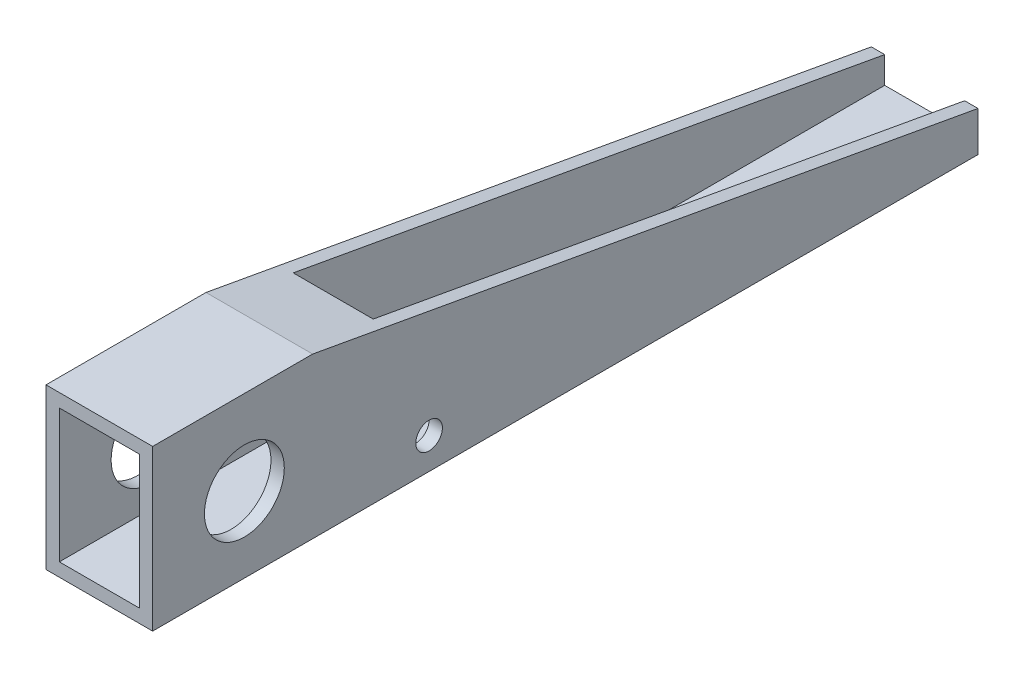
ISO-10303-21;
HEADER;
FILE_DESCRIPTION(('STEP AP214'),'2;1');
FILE_NAME('part.step','',(''),(''),'','','');
FILE_SCHEMA(('AUTOMOTIVE_DESIGN { 1 0 10303 214 1 1 1 1 }'));
ENDSEC;
DATA;
#1=APPLICATION_CONTEXT('core data for automotive mechanical design processes');
#2=APPLICATION_PROTOCOL_DEFINITION('international standard','automotive_design',2000,#1);
#3=PRODUCT_CONTEXT('',#1,'mechanical');
#4=PRODUCT('Part','Part','',(#3));
#5=PRODUCT_RELATED_PRODUCT_CATEGORY('part','',(#4));
#6=PRODUCT_DEFINITION_FORMATION('','',#4);
#7=PRODUCT_DEFINITION_CONTEXT('part definition',#1,'design');
#8=PRODUCT_DEFINITION('design','',#6,#7);
#9=PRODUCT_DEFINITION_SHAPE('','',#8);
#10=(LENGTH_UNIT() NAMED_UNIT(*) SI_UNIT(.MILLI.,.METRE.));
#11=(NAMED_UNIT(*) PLANE_ANGLE_UNIT() SI_UNIT($,.RADIAN.));
#12=(NAMED_UNIT(*) SI_UNIT($,.STERADIAN.) SOLID_ANGLE_UNIT());
#13=UNCERTAINTY_MEASURE_WITH_UNIT(LENGTH_MEASURE(1.E-05),#10,'distance_accuracy_value','');
#14=(GEOMETRIC_REPRESENTATION_CONTEXT(3) GLOBAL_UNCERTAINTY_ASSIGNED_CONTEXT((#13)) GLOBAL_UNIT_ASSIGNED_CONTEXT((#10,
#11,#12)) REPRESENTATION_CONTEXT('',''));
#15=CARTESIAN_POINT('',(0.,0.,0.));
#16=DIRECTION('',(0.,0.,1.));
#17=DIRECTION('',(1.,0.,0.));
#18=AXIS2_PLACEMENT_3D('',#15,#16,#17);
#19=CARTESIAN_POINT('',(0.,34.925,196.5706));
#20=DIRECTION('',(0.,-1.,0.));
#21=DIRECTION('',(0.,0.,-1.));
#22=AXIS2_PLACEMENT_3D('',#19,#20,#21);
#23=PLANE('',#22);
#24=DIRECTION('',(-1.,0.,0.));
#25=VECTOR('',#24,1.);
#26=CARTESIAN_POINT('',(0.,34.925,140.862755555556));
#27=LINE('',#26,#25);
#28=CARTESIAN_POINT('',(22.225,34.925,140.862755555556));
#29=VERTEX_POINT('',#28);
#30=CARTESIAN_POINT('',(3.175,34.925,140.862755555556));
#31=VERTEX_POINT('',#30);
#32=EDGE_CURVE('E193',#29,#31,#27,.T.);
#33=ORIENTED_EDGE('',*,*,#32,.F.);
#34=DIRECTION('',(0.,0.,-1.));
#35=VECTOR('',#34,1.);
#36=CARTESIAN_POINT('',(22.225,34.925,196.5706));
#37=LINE('',#36,#35);
#38=CARTESIAN_POINT('',(22.225,34.925,196.5706));
#39=VERTEX_POINT('',#38);
#40=EDGE_CURVE('E46',#39,#29,#37,.T.);
#41=ORIENTED_EDGE('',*,*,#40,.F.);
#42=DIRECTION('',(-1.,0.,0.));
#43=VECTOR('',#42,1.);
#44=CARTESIAN_POINT('',(0.,34.925,196.5706));
#45=LINE('',#44,#43);
#46=CARTESIAN_POINT('',(3.175,34.925,196.5706));
#47=VERTEX_POINT('',#46);
#48=EDGE_CURVE('E126',#39,#47,#45,.T.);
#49=ORIENTED_EDGE('',*,*,#48,.T.);
#50=DIRECTION('',(0.,0.,-1.));
#51=VECTOR('',#50,1.);
#52=CARTESIAN_POINT('',(3.175,34.925,196.5706));
#53=LINE('',#52,#51);
#54=EDGE_CURVE('E148',#47,#31,#53,.T.);
#55=ORIENTED_EDGE('',*,*,#54,.T.);
#56=EDGE_LOOP('',(#33,#41,#49,#55));
#57=FACE_BOUND('',#56,.T.);
#58=ADVANCED_FACE('F37',(#57),#23,.T.);
#59=CARTESIAN_POINT('',(22.225,0.,196.5706));
#60=DIRECTION('',(-1.,0.,0.));
#61=DIRECTION('',(0.,0.,1.));
#62=AXIS2_PLACEMENT_3D('',#59,#60,#61);
#63=PLANE('',#62);
#64=CARTESIAN_POINT('',(22.225,7.42583609972849,130.736416842445));
#65=DIRECTION('',(-1.,0.,0.));
#66=DIRECTION('',(0.,0.,1.));
#67=AXIS2_PLACEMENT_3D('',#64,#65,#66);
#68=CIRCLE('',#67,3.175);
#69=CARTESIAN_POINT('',(22.225,7.42583609972849,133.911416842445));
#70=VERTEX_POINT('',#69);
#71=EDGE_CURVE('E176',#70,#70,#68,.T.);
#72=ORIENTED_EDGE('',*,*,#71,.F.);
#73=EDGE_LOOP('',(#72));
#74=FACE_BOUND('',#73,.T.);
#75=CARTESIAN_POINT('',(22.225,17.9915299134255,174.7266));
#76=DIRECTION('',(-1.,0.,0.));
#77=DIRECTION('',(0.,0.,1.));
#78=AXIS2_PLACEMENT_3D('',#75,#76,#77);
#79=CIRCLE('',#78,9.51229999999999);
#80=CARTESIAN_POINT('',(22.225,17.9915299134255,184.2389));
#81=VERTEX_POINT('',#80);
#82=EDGE_CURVE('E164',#81,#81,#79,.T.);
#83=ORIENTED_EDGE('',*,*,#82,.F.);
#84=EDGE_LOOP('',(#83));
#85=FACE_BOUND('',#84,.T.);
#86=DIRECTION('',(0.,0.177455509994275,0.984128823870469));
#87=VECTOR('',#86,1.);
#88=CARTESIAN_POINT('',(22.225,43.5539625863128,188.717064512005));
#89=LINE('',#88,#87);
#90=CARTESIAN_POINT('',(22.225,9.52499999999997,0.));
#91=VERTEX_POINT('',#90);
#92=EDGE_CURVE('E138',#91,#29,#89,.T.);
#93=ORIENTED_EDGE('',*,*,#92,.F.);
#94=DIRECTION('',(0.,1.,0.));
#95=VECTOR('',#94,1.);
#96=CARTESIAN_POINT('',(22.225,0.,0.));
#97=LINE('',#96,#95);
#98=CARTESIAN_POINT('',(22.225,3.175,0.));
#99=VERTEX_POINT('',#98);
#100=EDGE_CURVE('E117',#99,#91,#97,.T.);
#101=ORIENTED_EDGE('',*,*,#100,.F.);
#102=DIRECTION('',(0.,0.,-1.));
#103=VECTOR('',#102,1.);
#104=CARTESIAN_POINT('',(22.225,3.175,196.5706));
#105=LINE('',#104,#103);
#106=CARTESIAN_POINT('',(22.225,3.175,196.5706));
#107=VERTEX_POINT('',#106);
#108=EDGE_CURVE('E110',#107,#99,#105,.T.);
#109=ORIENTED_EDGE('',*,*,#108,.F.);
#110=DIRECTION('',(0.,1.,0.));
#111=VECTOR('',#110,1.);
#112=CARTESIAN_POINT('',(22.225,0.,196.5706));
#113=LINE('',#112,#111);
#114=EDGE_CURVE('E115',#107,#39,#113,.T.);
#115=ORIENTED_EDGE('',*,*,#114,.T.);
#116=ORIENTED_EDGE('',*,*,#40,.T.);
#117=EDGE_LOOP('',(#93,#101,#109,#115,#116));
#118=FACE_BOUND('',#117,.T.);
#119=ADVANCED_FACE('F113',(#74,#85,#118),#63,.T.);
#120=CARTESIAN_POINT('',(0.,3.175,196.5706));
#121=DIRECTION('',(0.,1.,0.));
#122=DIRECTION('',(-1.,0.,0.));
#123=AXIS2_PLACEMENT_3D('',#120,#121,#122);
#124=PLANE('',#123);
#125=DIRECTION('',(1.,0.,0.));
#126=VECTOR('',#125,1.);
#127=CARTESIAN_POINT('',(0.,3.175,0.));
#128=LINE('',#127,#126);
#129=CARTESIAN_POINT('',(3.175,3.175,0.));
#130=VERTEX_POINT('',#129);
#131=EDGE_CURVE('E144',#130,#99,#128,.T.);
#132=ORIENTED_EDGE('',*,*,#131,.F.);
#133=DIRECTION('',(0.,0.,-1.));
#134=VECTOR('',#133,1.);
#135=CARTESIAN_POINT('',(3.175,3.175,196.5706));
#136=LINE('',#135,#134);
#137=CARTESIAN_POINT('',(3.175,3.175,196.5706));
#138=VERTEX_POINT('',#137);
#139=EDGE_CURVE('E83',#138,#130,#136,.T.);
#140=ORIENTED_EDGE('',*,*,#139,.F.);
#141=DIRECTION('',(1.,0.,0.));
#142=VECTOR('',#141,1.);
#143=CARTESIAN_POINT('',(0.,3.175,196.5706));
#144=LINE('',#143,#142);
#145=EDGE_CURVE('E124',#138,#107,#144,.T.);
#146=ORIENTED_EDGE('',*,*,#145,.T.);
#147=ORIENTED_EDGE('',*,*,#108,.T.);
#148=EDGE_LOOP('',(#132,#140,#146,#147));
#149=FACE_BOUND('',#148,.T.);
#150=ADVANCED_FACE('F128',(#149),#124,.T.);
#151=CARTESIAN_POINT('',(25.4,0.,196.5706));
#152=DIRECTION('',(-1.,0.,0.));
#153=DIRECTION('',(0.,0.,1.));
#154=AXIS2_PLACEMENT_3D('',#151,#152,#153);
#155=PLANE('',#154);
#156=CARTESIAN_POINT('',(25.4,7.42583609972849,130.736416842445));
#157=DIRECTION('',(1.,0.,0.));
#158=DIRECTION('',(0.,0.,-1.));
#159=AXIS2_PLACEMENT_3D('',#156,#157,#158);
#160=CIRCLE('',#159,3.175);
#161=CARTESIAN_POINT('',(25.4,7.42583609972849,127.561416842445));
#162=VERTEX_POINT('',#161);
#163=EDGE_CURVE('E273',#162,#162,#160,.T.);
#164=ORIENTED_EDGE('',*,*,#163,.F.);
#165=EDGE_LOOP('',(#164));
#166=FACE_BOUND('',#165,.T.);
#167=CARTESIAN_POINT('',(25.4,17.9915299134255,174.7266));
#168=DIRECTION('',(1.,0.,0.));
#169=DIRECTION('',(0.,0.,-1.));
#170=AXIS2_PLACEMENT_3D('',#167,#168,#169);
#171=CIRCLE('',#170,9.51229999999999);
#172=CARTESIAN_POINT('',(25.4,17.9915299134255,165.2143));
#173=VERTEX_POINT('',#172);
#174=EDGE_CURVE('E171',#173,#173,#171,.T.);
#175=ORIENTED_EDGE('',*,*,#174,.F.);
#176=EDGE_LOOP('',(#175));
#177=FACE_BOUND('',#176,.T.);
#178=DIRECTION('',(0.,1.,0.));
#179=VECTOR('',#178,1.);
#180=CARTESIAN_POINT('',(25.4,0.,0.));
#181=LINE('',#180,#179);
#182=CARTESIAN_POINT('',(25.4,0.,0.));
#183=VERTEX_POINT('',#182);
#184=CARTESIAN_POINT('',(25.4,9.52499999999997,0.));
#185=VERTEX_POINT('',#184);
#186=EDGE_CURVE('E134',#183,#185,#181,.T.);
#187=ORIENTED_EDGE('',*,*,#186,.T.);
#188=DIRECTION('',(0.,-0.177455509994275,-0.984128823870469));
#189=VECTOR('',#188,1.);
#190=CARTESIAN_POINT('',(25.4,38.1,158.4706));
#191=LINE('',#190,#189);
#192=CARTESIAN_POINT('',(25.4,38.1,158.4706));
#193=VERTEX_POINT('',#192);
#194=EDGE_CURVE('E54',#193,#185,#191,.T.);
#195=ORIENTED_EDGE('',*,*,#194,.F.);
#196=DIRECTION('',(0.,0.,-1.));
#197=VECTOR('',#196,1.);
#198=CARTESIAN_POINT('',(25.4,38.1,196.5706));
#199=LINE('',#198,#197);
#200=CARTESIAN_POINT('',(25.4,38.1,196.5706));
#201=VERTEX_POINT('',#200);
#202=EDGE_CURVE('E151',#201,#193,#199,.T.);
#203=ORIENTED_EDGE('',*,*,#202,.F.);
#204=DIRECTION('',(0.,1.,0.));
#205=VECTOR('',#204,1.);
#206=CARTESIAN_POINT('',(25.4,0.,196.5706));
#207=LINE('',#206,#205);
#208=CARTESIAN_POINT('',(25.4,0.,196.5706));
#209=VERTEX_POINT('',#208);
#210=EDGE_CURVE('E92',#209,#201,#207,.T.);
#211=ORIENTED_EDGE('',*,*,#210,.F.);
#212=DIRECTION('',(0.,0.,-1.));
#213=VECTOR('',#212,1.);
#214=CARTESIAN_POINT('',(25.4,0.,196.5706));
#215=LINE('',#214,#213);
#216=EDGE_CURVE('E130',#209,#183,#215,.T.);
#217=ORIENTED_EDGE('',*,*,#216,.T.);
#218=EDGE_LOOP('',(#187,#195,#203,#211,#217));
#219=FACE_BOUND('',#218,.T.);
#220=ADVANCED_FACE('F39',(#166,#177,#219),#155,.F.);
#221=CARTESIAN_POINT('',(0.,38.1,196.5706));
#222=DIRECTION('',(0.,1.,0.));
#223=DIRECTION('',(0.,0.,1.));
#224=AXIS2_PLACEMENT_3D('',#221,#222,#223);
#225=PLANE('',#224);
#226=DIRECTION('',(1.,0.,0.));
#227=VECTOR('',#226,1.);
#228=CARTESIAN_POINT('',(0.,38.1,158.4706));
#229=LINE('',#228,#227);
#230=CARTESIAN_POINT('',(0.,38.1,158.4706));
#231=VERTEX_POINT('',#230);
#232=EDGE_CURVE('E184',#231,#193,#229,.T.);
#233=ORIENTED_EDGE('',*,*,#232,.F.);
#234=DIRECTION('',(0.,0.,-1.));
#235=VECTOR('',#234,1.);
#236=CARTESIAN_POINT('',(0.,38.1,196.5706));
#237=LINE('',#236,#235);
#238=CARTESIAN_POINT('',(0.,38.1,196.5706));
#239=VERTEX_POINT('',#238);
#240=EDGE_CURVE('E158',#239,#231,#237,.T.);
#241=ORIENTED_EDGE('',*,*,#240,.F.);
#242=DIRECTION('',(1.,0.,0.));
#243=VECTOR('',#242,1.);
#244=CARTESIAN_POINT('',(0.,38.1,196.5706));
#245=LINE('',#244,#243);
#246=EDGE_CURVE('E199',#239,#201,#245,.T.);
#247=ORIENTED_EDGE('',*,*,#246,.T.);
#248=ORIENTED_EDGE('',*,*,#202,.T.);
#249=EDGE_LOOP('',(#233,#241,#247,#248));
#250=FACE_BOUND('',#249,.T.);
#251=ADVANCED_FACE('F227',(#250),#225,.T.);
#252=CARTESIAN_POINT('',(0.,0.,196.5706));
#253=DIRECTION('',(-1.,0.,0.));
#254=DIRECTION('',(0.,0.,1.));
#255=AXIS2_PLACEMENT_3D('',#252,#253,#254);
#256=PLANE('',#255);
#257=CARTESIAN_POINT('',(0.,7.42583609972849,130.736416842445));
#258=DIRECTION('',(1.,0.,0.));
#259=DIRECTION('',(0.,0.,-1.));
#260=AXIS2_PLACEMENT_3D('',#257,#258,#259);
#261=CIRCLE('',#260,3.175);
#262=CARTESIAN_POINT('',(0.,7.42583609972849,127.561416842445));
#263=VERTEX_POINT('',#262);
#264=EDGE_CURVE('E330',#263,#263,#261,.T.);
#265=ORIENTED_EDGE('',*,*,#264,.T.);
#266=EDGE_LOOP('',(#265));
#267=FACE_BOUND('',#266,.T.);
#268=CARTESIAN_POINT('',(0.,17.9915299134255,174.7266));
#269=DIRECTION('',(1.,0.,0.));
#270=DIRECTION('',(0.,0.,-1.));
#271=AXIS2_PLACEMENT_3D('',#268,#269,#270);
#272=CIRCLE('',#271,9.51229999999999);
#273=CARTESIAN_POINT('',(0.,17.9915299134255,165.2143));
#274=VERTEX_POINT('',#273);
#275=EDGE_CURVE('E165',#274,#274,#272,.T.);
#276=ORIENTED_EDGE('',*,*,#275,.T.);
#277=EDGE_LOOP('',(#276));
#278=FACE_BOUND('',#277,.T.);
#279=DIRECTION('',(0.,-0.177455509994275,-0.984128823870469));
#280=VECTOR('',#279,1.);
#281=CARTESIAN_POINT('',(0.,38.1,158.4706));
#282=LINE('',#281,#280);
#283=CARTESIAN_POINT('',(0.,9.52499999999997,0.));
#284=VERTEX_POINT('',#283);
#285=EDGE_CURVE('E181',#231,#284,#282,.T.);
#286=ORIENTED_EDGE('',*,*,#285,.T.);
#287=DIRECTION('',(0.,1.,0.));
#288=VECTOR('',#287,1.);
#289=CARTESIAN_POINT('',(0.,0.,0.));
#290=LINE('',#289,#288);
#291=CARTESIAN_POINT('',(0.,0.,0.));
#292=VERTEX_POINT('',#291);
#293=EDGE_CURVE('E137',#292,#284,#290,.T.);
#294=ORIENTED_EDGE('',*,*,#293,.F.);
#295=DIRECTION('',(0.,0.,-1.));
#296=VECTOR('',#295,1.);
#297=CARTESIAN_POINT('',(0.,0.,196.5706));
#298=LINE('',#297,#296);
#299=CARTESIAN_POINT('',(0.,0.,196.5706));
#300=VERTEX_POINT('',#299);
#301=EDGE_CURVE('E156',#300,#292,#298,.T.);
#302=ORIENTED_EDGE('',*,*,#301,.F.);
#303=DIRECTION('',(0.,1.,0.));
#304=VECTOR('',#303,1.);
#305=CARTESIAN_POINT('',(0.,0.,196.5706));
#306=LINE('',#305,#304);
#307=EDGE_CURVE('E202',#300,#239,#306,.T.);
#308=ORIENTED_EDGE('',*,*,#307,.T.);
#309=ORIENTED_EDGE('',*,*,#240,.T.);
#310=EDGE_LOOP('',(#286,#294,#302,#308,#309));
#311=FACE_BOUND('',#310,.T.);
#312=ADVANCED_FACE('F228',(#267,#278,#311),#256,.T.);
#313=CARTESIAN_POINT('',(0.,0.,196.5706));
#314=DIRECTION('',(0.,1.,0.));
#315=DIRECTION('',(0.,0.,1.));
#316=AXIS2_PLACEMENT_3D('',#313,#314,#315);
#317=PLANE('',#316);
#318=DIRECTION('',(1.,0.,0.));
#319=VECTOR('',#318,1.);
#320=CARTESIAN_POINT('',(0.,0.,0.));
#321=LINE('',#320,#319);
#322=EDGE_CURVE('E141',#292,#183,#321,.T.);
#323=ORIENTED_EDGE('',*,*,#322,.T.);
#324=ORIENTED_EDGE('',*,*,#216,.F.);
#325=DIRECTION('',(1.,0.,0.));
#326=VECTOR('',#325,1.);
#327=CARTESIAN_POINT('',(0.,0.,196.5706));
#328=LINE('',#327,#326);
#329=EDGE_CURVE('E205',#300,#209,#328,.T.);
#330=ORIENTED_EDGE('',*,*,#329,.F.);
#331=ORIENTED_EDGE('',*,*,#301,.T.);
#332=EDGE_LOOP('',(#323,#324,#330,#331));
#333=FACE_BOUND('',#332,.T.);
#334=ADVANCED_FACE('F233',(#333),#317,.F.);
#335=CARTESIAN_POINT('',(3.175,0.,196.5706));
#336=DIRECTION('',(-1.,0.,0.));
#337=DIRECTION('',(0.,0.,1.));
#338=AXIS2_PLACEMENT_3D('',#335,#336,#337);
#339=PLANE('',#338);
#340=CARTESIAN_POINT('',(3.175,7.42583609972849,130.736416842445));
#341=DIRECTION('',(-1.,0.,0.));
#342=DIRECTION('',(0.,0.,1.));
#343=AXIS2_PLACEMENT_3D('',#340,#341,#342);
#344=CIRCLE('',#343,3.175);
#345=CARTESIAN_POINT('',(3.175,7.42583609972849,133.911416842445));
#346=VERTEX_POINT('',#345);
#347=EDGE_CURVE('E41',#346,#346,#344,.T.);
#348=ORIENTED_EDGE('',*,*,#347,.T.);
#349=EDGE_LOOP('',(#348));
#350=FACE_BOUND('',#349,.T.);
#351=CARTESIAN_POINT('',(3.175,17.9915299134255,174.7266));
#352=DIRECTION('',(-1.,0.,0.));
#353=DIRECTION('',(0.,0.,1.));
#354=AXIS2_PLACEMENT_3D('',#351,#352,#353);
#355=CIRCLE('',#354,9.51229999999999);
#356=CARTESIAN_POINT('',(3.175,17.9915299134255,184.2389));
#357=VERTEX_POINT('',#356);
#358=EDGE_CURVE('E162',#357,#357,#355,.T.);
#359=ORIENTED_EDGE('',*,*,#358,.T.);
#360=EDGE_LOOP('',(#359));
#361=FACE_BOUND('',#360,.T.);
#362=DIRECTION('',(0.,1.,0.));
#363=VECTOR('',#362,1.);
#364=CARTESIAN_POINT('',(3.175,0.,0.));
#365=LINE('',#364,#363);
#366=CARTESIAN_POINT('',(3.175,9.52499999999997,0.));
#367=VERTEX_POINT('',#366);
#368=EDGE_CURVE('E146',#130,#367,#365,.T.);
#369=ORIENTED_EDGE('',*,*,#368,.T.);
#370=DIRECTION('',(0.,0.177455509994275,0.984128823870469));
#371=VECTOR('',#370,1.);
#372=CARTESIAN_POINT('',(3.175,43.5539625863128,188.717064512005));
#373=LINE('',#372,#371);
#374=EDGE_CURVE('E189',#367,#31,#373,.T.);
#375=ORIENTED_EDGE('',*,*,#374,.T.);
#376=ORIENTED_EDGE('',*,*,#54,.F.);
#377=DIRECTION('',(0.,1.,0.));
#378=VECTOR('',#377,1.);
#379=CARTESIAN_POINT('',(3.175,0.,196.5706));
#380=LINE('',#379,#378);
#381=EDGE_CURVE('E62',#138,#47,#380,.T.);
#382=ORIENTED_EDGE('',*,*,#381,.F.);
#383=ORIENTED_EDGE('',*,*,#139,.T.);
#384=EDGE_LOOP('',(#369,#375,#376,#382,#383));
#385=FACE_BOUND('',#384,.T.);
#386=ADVANCED_FACE('F239',(#350,#361,#385),#339,.F.);
#387=CARTESIAN_POINT('',(0.,0.,196.5706));
#388=DIRECTION('',(0.,0.,1.));
#389=DIRECTION('',(1.,0.,0.));
#390=AXIS2_PLACEMENT_3D('',#387,#388,#389);
#391=PLANE('',#390);
#392=ORIENTED_EDGE('',*,*,#210,.T.);
#393=ORIENTED_EDGE('',*,*,#246,.F.);
#394=ORIENTED_EDGE('',*,*,#307,.F.);
#395=ORIENTED_EDGE('',*,*,#329,.T.);
#396=EDGE_LOOP('',(#392,#393,#394,#395));
#397=FACE_BOUND('',#396,.T.);
#398=ORIENTED_EDGE('',*,*,#48,.F.);
#399=ORIENTED_EDGE('',*,*,#114,.F.);
#400=ORIENTED_EDGE('',*,*,#145,.F.);
#401=ORIENTED_EDGE('',*,*,#381,.T.);
#402=EDGE_LOOP('',(#398,#399,#400,#401));
#403=FACE_BOUND('',#402,.T.);
#404=ADVANCED_FACE('F123',(#397,#403),#391,.T.);
#405=CARTESIAN_POINT('',(0.,0.,0.));
#406=DIRECTION('',(0.,0.,1.));
#407=DIRECTION('',(1.,0.,0.));
#408=AXIS2_PLACEMENT_3D('',#405,#406,#407);
#409=PLANE('',#408);
#410=ORIENTED_EDGE('',*,*,#293,.T.);
#411=DIRECTION('',(1.,0.,0.));
#412=VECTOR('',#411,1.);
#413=CARTESIAN_POINT('',(0.,9.52499999999997,0.));
#414=LINE('',#413,#412);
#415=EDGE_CURVE('E186',#284,#367,#414,.T.);
#416=ORIENTED_EDGE('',*,*,#415,.T.);
#417=ORIENTED_EDGE('',*,*,#368,.F.);
#418=ORIENTED_EDGE('',*,*,#131,.T.);
#419=ORIENTED_EDGE('',*,*,#100,.T.);
#420=DIRECTION('',(1.,0.,0.));
#421=VECTOR('',#420,1.);
#422=CARTESIAN_POINT('',(0.,9.52499999999997,0.));
#423=LINE('',#422,#421);
#424=EDGE_CURVE('E11',#91,#185,#423,.T.);
#425=ORIENTED_EDGE('',*,*,#424,.T.);
#426=ORIENTED_EDGE('',*,*,#186,.F.);
#427=ORIENTED_EDGE('',*,*,#322,.F.);
#428=EDGE_LOOP('',(#410,#416,#417,#418,#419,#425,#426,#427));
#429=FACE_BOUND('',#428,.T.);
#430=ADVANCED_FACE('F238',(#429),#409,.F.);
#431=CARTESIAN_POINT('',(0.,38.1,158.4706));
#432=DIRECTION('',(0.,-0.984128823870469,0.177455509994275));
#433=DIRECTION('',(0.,-0.177455509994275,-0.984128823870469));
#434=AXIS2_PLACEMENT_3D('',#431,#432,#433);
#435=PLANE('',#434);
#436=ORIENTED_EDGE('',*,*,#92,.T.);
#437=ORIENTED_EDGE('',*,*,#32,.T.);
#438=ORIENTED_EDGE('',*,*,#374,.F.);
#439=ORIENTED_EDGE('',*,*,#415,.F.);
#440=ORIENTED_EDGE('',*,*,#285,.F.);
#441=ORIENTED_EDGE('',*,*,#232,.T.);
#442=ORIENTED_EDGE('',*,*,#194,.T.);
#443=ORIENTED_EDGE('',*,*,#424,.F.);
#444=EDGE_LOOP('',(#436,#437,#438,#439,#440,#441,#442,#443));
#445=FACE_BOUND('',#444,.T.);
#446=ADVANCED_FACE('F223',(#445),#435,.F.);
#447=CARTESIAN_POINT('',(0.,17.9915299134255,174.7266));
#448=DIRECTION('',(1.,0.,0.));
#449=DIRECTION('',(0.,0.,-1.));
#450=AXIS2_PLACEMENT_3D('',#447,#448,#449);
#451=CYLINDRICAL_SURFACE('',#450,9.51229999999999);
#452=ORIENTED_EDGE('',*,*,#275,.F.);
#453=EDGE_LOOP('',(#452));
#454=FACE_BOUND('',#453,.T.);
#455=ORIENTED_EDGE('',*,*,#358,.F.);
#456=EDGE_LOOP('',(#455));
#457=FACE_BOUND('',#456,.T.);
#458=ADVANCED_FACE('F279',(#454,#457),#451,.F.);
#459=ORIENTED_EDGE('',*,*,#82,.T.);
#460=EDGE_LOOP('',(#459));
#461=FACE_BOUND('',#460,.T.);
#462=ORIENTED_EDGE('',*,*,#174,.T.);
#463=EDGE_LOOP('',(#462));
#464=FACE_BOUND('',#463,.T.);
#465=ADVANCED_FACE('F276',(#461,#464),#451,.F.);
#466=CARTESIAN_POINT('',(0.,7.42583609972849,130.736416842445));
#467=DIRECTION('',(1.,0.,0.));
#468=DIRECTION('',(0.,0.,-1.));
#469=AXIS2_PLACEMENT_3D('',#466,#467,#468);
#470=CYLINDRICAL_SURFACE('',#469,3.175);
#471=ORIENTED_EDGE('',*,*,#264,.F.);
#472=EDGE_LOOP('',(#471));
#473=FACE_BOUND('',#472,.T.);
#474=ORIENTED_EDGE('',*,*,#347,.F.);
#475=EDGE_LOOP('',(#474));
#476=FACE_BOUND('',#475,.T.);
#477=ADVANCED_FACE('F278',(#473,#476),#470,.F.);
#478=ORIENTED_EDGE('',*,*,#71,.T.);
#479=EDGE_LOOP('',(#478));
#480=FACE_BOUND('',#479,.T.);
#481=ORIENTED_EDGE('',*,*,#163,.T.);
#482=EDGE_LOOP('',(#481));
#483=FACE_BOUND('',#482,.T.);
#484=ADVANCED_FACE('F286',(#480,#483),#470,.F.);
#485=CLOSED_SHELL('',(#58,#119,#150,#220,#251,#312,#334,#386,#404,#430,#446,#458,#465,#477,#484));
#486=MANIFOLD_SOLID_BREP('B2',#485);
#487=ADVANCED_BREP_SHAPE_REPRESENTATION('',(#18,#486),#14);
#488=SHAPE_DEFINITION_REPRESENTATION(#9,#487);
ENDSEC;
END-ISO-10303-21;
